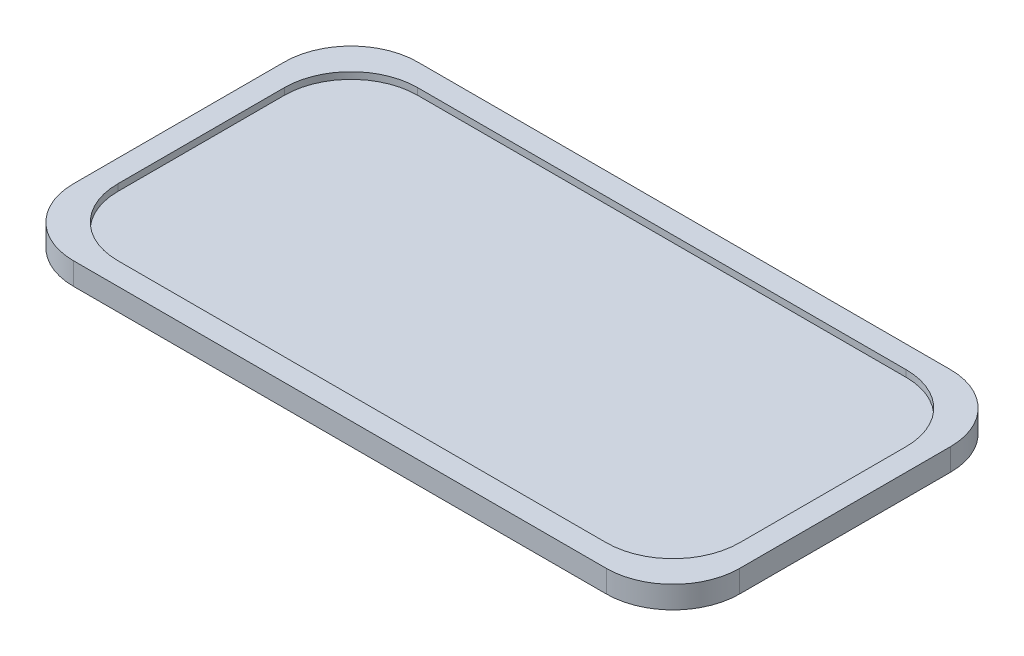
ISO-10303-21;
HEADER;
FILE_DESCRIPTION(('STEP AP214'),'2;1');
FILE_NAME('part.step','',(''),(''),'','','');
FILE_SCHEMA(('AUTOMOTIVE_DESIGN { 1 0 10303 214 1 1 1 1 }'));
ENDSEC;
DATA;
#1=APPLICATION_CONTEXT('core data for automotive mechanical design processes');
#2=APPLICATION_PROTOCOL_DEFINITION('international standard','automotive_design',2000,#1);
#3=PRODUCT_CONTEXT('',#1,'mechanical');
#4=PRODUCT('Part','Part','',(#3));
#5=PRODUCT_RELATED_PRODUCT_CATEGORY('part','',(#4));
#6=PRODUCT_DEFINITION_FORMATION('','',#4);
#7=PRODUCT_DEFINITION_CONTEXT('part definition',#1,'design');
#8=PRODUCT_DEFINITION('design','',#6,#7);
#9=PRODUCT_DEFINITION_SHAPE('','',#8);
#10=(LENGTH_UNIT() NAMED_UNIT(*) SI_UNIT(.MILLI.,.METRE.));
#11=(NAMED_UNIT(*) PLANE_ANGLE_UNIT() SI_UNIT($,.RADIAN.));
#12=(NAMED_UNIT(*) SI_UNIT($,.STERADIAN.) SOLID_ANGLE_UNIT());
#13=UNCERTAINTY_MEASURE_WITH_UNIT(LENGTH_MEASURE(1.E-05),#10,'distance_accuracy_value','');
#14=(GEOMETRIC_REPRESENTATION_CONTEXT(3) GLOBAL_UNCERTAINTY_ASSIGNED_CONTEXT((#13)) GLOBAL_UNIT_ASSIGNED_CONTEXT((#10,
#11,#12)) REPRESENTATION_CONTEXT('',''));
#15=CARTESIAN_POINT('',(0.,0.,0.));
#16=DIRECTION('',(0.,0.,1.));
#17=DIRECTION('',(1.,0.,0.));
#18=AXIS2_PLACEMENT_3D('',#15,#16,#17);
#19=CARTESIAN_POINT('',(120.,10.,-47.5));
#20=DIRECTION('',(0.,-1.,0.));
#21=DIRECTION('',(0.,0.,-1.));
#22=AXIS2_PLACEMENT_3D('',#19,#20,#21);
#23=CYLINDRICAL_SURFACE('',#22,30.);
#24=CARTESIAN_POINT('',(120.,0.,-47.5));
#25=DIRECTION('',(0.,1.,0.));
#26=DIRECTION('',(0.,0.,1.));
#27=AXIS2_PLACEMENT_3D('',#24,#25,#26);
#28=CIRCLE('',#27,30.);
#29=CARTESIAN_POINT('',(150.,0.,-47.5));
#30=VERTEX_POINT('',#29);
#31=CARTESIAN_POINT('',(120.,0.,-77.5));
#32=VERTEX_POINT('',#31);
#33=EDGE_CURVE('E424',#30,#32,#28,.T.);
#34=ORIENTED_EDGE('',*,*,#33,.T.);
#35=DIRECTION('',(0.,-1.,0.));
#36=VECTOR('',#35,1.);
#37=CARTESIAN_POINT('',(120.,10.,-77.5));
#38=LINE('',#37,#36);
#39=CARTESIAN_POINT('',(120.,10.,-77.5));
#40=VERTEX_POINT('',#39);
#41=EDGE_CURVE('E11',#40,#32,#38,.T.);
#42=ORIENTED_EDGE('',*,*,#41,.F.);
#43=CARTESIAN_POINT('',(120.,10.,-47.5));
#44=DIRECTION('',(0.,1.,0.));
#45=DIRECTION('',(0.,0.,1.));
#46=AXIS2_PLACEMENT_3D('',#43,#44,#45);
#47=CIRCLE('',#46,30.);
#48=CARTESIAN_POINT('',(150.,10.,-47.5));
#49=VERTEX_POINT('',#48);
#50=EDGE_CURVE('E438',#49,#40,#47,.T.);
#51=ORIENTED_EDGE('',*,*,#50,.F.);
#52=DIRECTION('',(0.,-1.,0.));
#53=VECTOR('',#52,1.);
#54=CARTESIAN_POINT('',(150.,10.,-47.5));
#55=LINE('',#54,#53);
#56=EDGE_CURVE('E456',#49,#30,#55,.T.);
#57=ORIENTED_EDGE('',*,*,#56,.T.);
#58=EDGE_LOOP('',(#34,#42,#51,#57));
#59=FACE_BOUND('',#58,.T.);
#60=ADVANCED_FACE('F32',(#59),#23,.T.);
#61=CARTESIAN_POINT('',(-120.,10.,-77.5));
#62=DIRECTION('',(0.,0.,1.));
#63=DIRECTION('',(1.,0.,0.));
#64=AXIS2_PLACEMENT_3D('',#61,#62,#63);
#65=PLANE('',#64);
#66=DIRECTION('',(-1.,0.,0.));
#67=VECTOR('',#66,1.);
#68=CARTESIAN_POINT('',(-120.,0.,-77.5));
#69=LINE('',#68,#67);
#70=CARTESIAN_POINT('',(-120.,0.,-77.5));
#71=VERTEX_POINT('',#70);
#72=EDGE_CURVE('E459',#32,#71,#69,.T.);
#73=ORIENTED_EDGE('',*,*,#72,.T.);
#74=DIRECTION('',(0.,-1.,0.));
#75=VECTOR('',#74,1.);
#76=CARTESIAN_POINT('',(-120.,10.,-77.5));
#77=LINE('',#76,#75);
#78=CARTESIAN_POINT('',(-120.,10.,-77.5));
#79=VERTEX_POINT('',#78);
#80=EDGE_CURVE('E39',#79,#71,#77,.T.);
#81=ORIENTED_EDGE('',*,*,#80,.F.);
#82=DIRECTION('',(-1.,0.,0.));
#83=VECTOR('',#82,1.);
#84=CARTESIAN_POINT('',(-120.,10.,-77.5));
#85=LINE('',#84,#83);
#86=EDGE_CURVE('E441',#40,#79,#85,.T.);
#87=ORIENTED_EDGE('',*,*,#86,.F.);
#88=ORIENTED_EDGE('',*,*,#41,.T.);
#89=EDGE_LOOP('',(#73,#81,#87,#88));
#90=FACE_BOUND('',#89,.T.);
#91=ADVANCED_FACE('F516',(#90),#65,.F.);
#92=CARTESIAN_POINT('',(-120.,10.,-47.5));
#93=DIRECTION('',(0.,-1.,0.));
#94=DIRECTION('',(0.,0.,-1.));
#95=AXIS2_PLACEMENT_3D('',#92,#93,#94);
#96=CYLINDRICAL_SURFACE('',#95,30.);
#97=CARTESIAN_POINT('',(-120.,0.,-47.5));
#98=DIRECTION('',(0.,1.,0.));
#99=DIRECTION('',(0.,0.,-1.));
#100=AXIS2_PLACEMENT_3D('',#97,#98,#99);
#101=CIRCLE('',#100,30.);
#102=CARTESIAN_POINT('',(-150.,0.,-47.5));
#103=VERTEX_POINT('',#102);
#104=EDGE_CURVE('E461',#71,#103,#101,.T.);
#105=ORIENTED_EDGE('',*,*,#104,.T.);
#106=DIRECTION('',(0.,-1.,0.));
#107=VECTOR('',#106,1.);
#108=CARTESIAN_POINT('',(-150.,10.,-47.5));
#109=LINE('',#108,#107);
#110=CARTESIAN_POINT('',(-150.,10.,-47.5));
#111=VERTEX_POINT('',#110);
#112=EDGE_CURVE('E486',#111,#103,#109,.T.);
#113=ORIENTED_EDGE('',*,*,#112,.F.);
#114=CARTESIAN_POINT('',(-120.,10.,-47.5));
#115=DIRECTION('',(0.,1.,0.));
#116=DIRECTION('',(0.,0.,-1.));
#117=AXIS2_PLACEMENT_3D('',#114,#115,#116);
#118=CIRCLE('',#117,30.);
#119=EDGE_CURVE('E444',#79,#111,#118,.T.);
#120=ORIENTED_EDGE('',*,*,#119,.F.);
#121=ORIENTED_EDGE('',*,*,#80,.T.);
#122=EDGE_LOOP('',(#105,#113,#120,#121));
#123=FACE_BOUND('',#122,.T.);
#124=ADVANCED_FACE('F493',(#123),#96,.T.);
#125=CARTESIAN_POINT('',(-150.,10.,-47.5));
#126=DIRECTION('',(1.,0.,0.));
#127=DIRECTION('',(0.,0.,-1.));
#128=AXIS2_PLACEMENT_3D('',#125,#126,#127);
#129=PLANE('',#128);
#130=DIRECTION('',(0.,0.,1.));
#131=VECTOR('',#130,1.);
#132=CARTESIAN_POINT('',(-150.,0.,-47.5));
#133=LINE('',#132,#131);
#134=CARTESIAN_POINT('',(-150.,0.,47.5));
#135=VERTEX_POINT('',#134);
#136=EDGE_CURVE('E463',#103,#135,#133,.T.);
#137=ORIENTED_EDGE('',*,*,#136,.T.);
#138=DIRECTION('',(0.,-1.,0.));
#139=VECTOR('',#138,1.);
#140=CARTESIAN_POINT('',(-150.,10.,47.5));
#141=LINE('',#140,#139);
#142=CARTESIAN_POINT('',(-150.,10.,47.5));
#143=VERTEX_POINT('',#142);
#144=EDGE_CURVE('E483',#143,#135,#141,.T.);
#145=ORIENTED_EDGE('',*,*,#144,.F.);
#146=DIRECTION('',(0.,0.,1.));
#147=VECTOR('',#146,1.);
#148=CARTESIAN_POINT('',(-150.,10.,-47.5));
#149=LINE('',#148,#147);
#150=EDGE_CURVE('E446',#111,#143,#149,.T.);
#151=ORIENTED_EDGE('',*,*,#150,.F.);
#152=ORIENTED_EDGE('',*,*,#112,.T.);
#153=EDGE_LOOP('',(#137,#145,#151,#152));
#154=FACE_BOUND('',#153,.T.);
#155=ADVANCED_FACE('F504',(#154),#129,.F.);
#156=CARTESIAN_POINT('',(-120.,10.,47.5));
#157=DIRECTION('',(0.,-1.,0.));
#158=DIRECTION('',(0.,0.,-1.));
#159=AXIS2_PLACEMENT_3D('',#156,#157,#158);
#160=CYLINDRICAL_SURFACE('',#159,30.);
#161=CARTESIAN_POINT('',(-120.,0.,47.5));
#162=DIRECTION('',(0.,1.,0.));
#163=DIRECTION('',(0.,0.,-1.));
#164=AXIS2_PLACEMENT_3D('',#161,#162,#163);
#165=CIRCLE('',#164,30.);
#166=CARTESIAN_POINT('',(-120.,0.,77.5));
#167=VERTEX_POINT('',#166);
#168=EDGE_CURVE('E465',#135,#167,#165,.T.);
#169=ORIENTED_EDGE('',*,*,#168,.T.);
#170=DIRECTION('',(0.,-1.,0.));
#171=VECTOR('',#170,1.);
#172=CARTESIAN_POINT('',(-120.,10.,77.5));
#173=LINE('',#172,#171);
#174=CARTESIAN_POINT('',(-120.,10.,77.5));
#175=VERTEX_POINT('',#174);
#176=EDGE_CURVE('E480',#175,#167,#173,.T.);
#177=ORIENTED_EDGE('',*,*,#176,.F.);
#178=CARTESIAN_POINT('',(-120.,10.,47.5));
#179=DIRECTION('',(0.,1.,0.));
#180=DIRECTION('',(0.,0.,-1.));
#181=AXIS2_PLACEMENT_3D('',#178,#179,#180);
#182=CIRCLE('',#181,30.);
#183=EDGE_CURVE('E448',#143,#175,#182,.T.);
#184=ORIENTED_EDGE('',*,*,#183,.F.);
#185=ORIENTED_EDGE('',*,*,#144,.T.);
#186=EDGE_LOOP('',(#169,#177,#184,#185));
#187=FACE_BOUND('',#186,.T.);
#188=ADVANCED_FACE('F508',(#187),#160,.T.);
#189=CARTESIAN_POINT('',(-120.,10.,77.5));
#190=DIRECTION('',(0.,0.,-1.));
#191=DIRECTION('',(-1.,0.,0.));
#192=AXIS2_PLACEMENT_3D('',#189,#190,#191);
#193=PLANE('',#192);
#194=DIRECTION('',(1.,0.,0.));
#195=VECTOR('',#194,1.);
#196=CARTESIAN_POINT('',(-120.,0.,77.5));
#197=LINE('',#196,#195);
#198=CARTESIAN_POINT('',(120.,0.,77.5));
#199=VERTEX_POINT('',#198);
#200=EDGE_CURVE('E467',#167,#199,#197,.T.);
#201=ORIENTED_EDGE('',*,*,#200,.T.);
#202=DIRECTION('',(0.,-1.,0.));
#203=VECTOR('',#202,1.);
#204=CARTESIAN_POINT('',(120.,10.,77.5));
#205=LINE('',#204,#203);
#206=CARTESIAN_POINT('',(120.,10.,77.5));
#207=VERTEX_POINT('',#206);
#208=EDGE_CURVE('E477',#207,#199,#205,.T.);
#209=ORIENTED_EDGE('',*,*,#208,.F.);
#210=DIRECTION('',(1.,0.,0.));
#211=VECTOR('',#210,1.);
#212=CARTESIAN_POINT('',(-120.,10.,77.5));
#213=LINE('',#212,#211);
#214=EDGE_CURVE('E450',#175,#207,#213,.T.);
#215=ORIENTED_EDGE('',*,*,#214,.F.);
#216=ORIENTED_EDGE('',*,*,#176,.T.);
#217=EDGE_LOOP('',(#201,#209,#215,#216));
#218=FACE_BOUND('',#217,.T.);
#219=ADVANCED_FACE('F529',(#218),#193,.F.);
#220=CARTESIAN_POINT('',(120.,10.,47.5));
#221=DIRECTION('',(0.,-1.,0.));
#222=DIRECTION('',(0.,0.,-1.));
#223=AXIS2_PLACEMENT_3D('',#220,#221,#222);
#224=CYLINDRICAL_SURFACE('',#223,30.);
#225=CARTESIAN_POINT('',(120.,0.,47.5));
#226=DIRECTION('',(0.,1.,0.));
#227=DIRECTION('',(0.,0.,1.));
#228=AXIS2_PLACEMENT_3D('',#225,#226,#227);
#229=CIRCLE('',#228,30.);
#230=CARTESIAN_POINT('',(150.,0.,47.5));
#231=VERTEX_POINT('',#230);
#232=EDGE_CURVE('E469',#199,#231,#229,.T.);
#233=ORIENTED_EDGE('',*,*,#232,.T.);
#234=DIRECTION('',(0.,-1.,0.));
#235=VECTOR('',#234,1.);
#236=CARTESIAN_POINT('',(150.,10.,47.5));
#237=LINE('',#236,#235);
#238=CARTESIAN_POINT('',(150.,10.,47.5));
#239=VERTEX_POINT('',#238);
#240=EDGE_CURVE('E474',#239,#231,#237,.T.);
#241=ORIENTED_EDGE('',*,*,#240,.F.);
#242=CARTESIAN_POINT('',(120.,10.,47.5));
#243=DIRECTION('',(0.,1.,0.));
#244=DIRECTION('',(0.,0.,1.));
#245=AXIS2_PLACEMENT_3D('',#242,#243,#244);
#246=CIRCLE('',#245,30.);
#247=EDGE_CURVE('E452',#207,#239,#246,.T.);
#248=ORIENTED_EDGE('',*,*,#247,.F.);
#249=ORIENTED_EDGE('',*,*,#208,.T.);
#250=EDGE_LOOP('',(#233,#241,#248,#249));
#251=FACE_BOUND('',#250,.T.);
#252=ADVANCED_FACE('F527',(#251),#224,.T.);
#253=CARTESIAN_POINT('',(150.,10.,-47.5));
#254=DIRECTION('',(-1.,0.,0.));
#255=DIRECTION('',(0.,0.,1.));
#256=AXIS2_PLACEMENT_3D('',#253,#254,#255);
#257=PLANE('',#256);
#258=DIRECTION('',(0.,0.,-1.));
#259=VECTOR('',#258,1.);
#260=CARTESIAN_POINT('',(150.,0.,-47.5));
#261=LINE('',#260,#259);
#262=EDGE_CURVE('E442',#231,#30,#261,.T.);
#263=ORIENTED_EDGE('',*,*,#262,.T.);
#264=ORIENTED_EDGE('',*,*,#56,.F.);
#265=DIRECTION('',(0.,0.,-1.));
#266=VECTOR('',#265,1.);
#267=CARTESIAN_POINT('',(150.,10.,-47.5));
#268=LINE('',#267,#266);
#269=EDGE_CURVE('E454',#239,#49,#268,.T.);
#270=ORIENTED_EDGE('',*,*,#269,.F.);
#271=ORIENTED_EDGE('',*,*,#240,.T.);
#272=EDGE_LOOP('',(#263,#264,#270,#271));
#273=FACE_BOUND('',#272,.T.);
#274=ADVANCED_FACE('F522',(#273),#257,.F.);
#275=CARTESIAN_POINT('',(120.,10.,-47.5));
#276=DIRECTION('',(0.,1.,0.));
#277=DIRECTION('',(0.,0.,1.));
#278=AXIS2_PLACEMENT_3D('',#275,#276,#277);
#279=PLANE('',#278);
#280=CARTESIAN_POINT('',(110.,10.,-37.5));
#281=DIRECTION('',(0.,1.,0.));
#282=DIRECTION('',(0.,0.,1.));
#283=AXIS2_PLACEMENT_3D('',#280,#281,#282);
#284=CIRCLE('',#283,30.);
#285=CARTESIAN_POINT('',(140.,10.,-37.5));
#286=VERTEX_POINT('',#285);
#287=CARTESIAN_POINT('',(110.,10.,-67.5));
#288=VERTEX_POINT('',#287);
#289=EDGE_CURVE('E46',#286,#288,#284,.T.);
#290=ORIENTED_EDGE('',*,*,#289,.F.);
#291=DIRECTION('',(0.,0.,-1.));
#292=VECTOR('',#291,1.);
#293=CARTESIAN_POINT('',(140.,10.,-37.5));
#294=LINE('',#293,#292);
#295=CARTESIAN_POINT('',(140.,10.,37.5));
#296=VERTEX_POINT('',#295);
#297=EDGE_CURVE('E261',#296,#286,#294,.T.);
#298=ORIENTED_EDGE('',*,*,#297,.F.);
#299=CARTESIAN_POINT('',(110.,10.,37.5));
#300=DIRECTION('',(0.,1.,0.));
#301=DIRECTION('',(0.,0.,1.));
#302=AXIS2_PLACEMENT_3D('',#299,#300,#301);
#303=CIRCLE('',#302,30.);
#304=CARTESIAN_POINT('',(110.,10.,67.5));
#305=VERTEX_POINT('',#304);
#306=EDGE_CURVE('E264',#305,#296,#303,.T.);
#307=ORIENTED_EDGE('',*,*,#306,.F.);
#308=DIRECTION('',(1.,0.,0.));
#309=VECTOR('',#308,1.);
#310=CARTESIAN_POINT('',(-110.,10.,67.5));
#311=LINE('',#310,#309);
#312=CARTESIAN_POINT('',(-110.,10.,67.5));
#313=VERTEX_POINT('',#312);
#314=EDGE_CURVE('E292',#313,#305,#311,.T.);
#315=ORIENTED_EDGE('',*,*,#314,.F.);
#316=CARTESIAN_POINT('',(-110.,10.,37.5));
#317=DIRECTION('',(0.,1.,0.));
#318=DIRECTION('',(0.,0.,-1.));
#319=AXIS2_PLACEMENT_3D('',#316,#317,#318);
#320=CIRCLE('',#319,30.);
#321=CARTESIAN_POINT('',(-140.,10.,37.5));
#322=VERTEX_POINT('',#321);
#323=EDGE_CURVE('E289',#322,#313,#320,.T.);
#324=ORIENTED_EDGE('',*,*,#323,.F.);
#325=DIRECTION('',(0.,0.,1.));
#326=VECTOR('',#325,1.);
#327=CARTESIAN_POINT('',(-140.,10.,-37.5));
#328=LINE('',#327,#326);
#329=CARTESIAN_POINT('',(-140.,10.,-37.5));
#330=VERTEX_POINT('',#329);
#331=EDGE_CURVE('E286',#330,#322,#328,.T.);
#332=ORIENTED_EDGE('',*,*,#331,.F.);
#333=CARTESIAN_POINT('',(-110.,10.,-37.5));
#334=DIRECTION('',(0.,1.,0.));
#335=DIRECTION('',(0.,0.,-1.));
#336=AXIS2_PLACEMENT_3D('',#333,#334,#335);
#337=CIRCLE('',#336,30.);
#338=CARTESIAN_POINT('',(-110.,10.,-67.5));
#339=VERTEX_POINT('',#338);
#340=EDGE_CURVE('E283',#339,#330,#337,.T.);
#341=ORIENTED_EDGE('',*,*,#340,.F.);
#342=DIRECTION('',(-1.,0.,0.));
#343=VECTOR('',#342,1.);
#344=CARTESIAN_POINT('',(-110.,10.,-67.5));
#345=LINE('',#344,#343);
#346=EDGE_CURVE('E281',#288,#339,#345,.T.);
#347=ORIENTED_EDGE('',*,*,#346,.F.);
#348=EDGE_LOOP('',(#290,#298,#307,#315,#324,#332,#341,#347));
#349=FACE_BOUND('',#348,.T.);
#350=ORIENTED_EDGE('',*,*,#50,.T.);
#351=ORIENTED_EDGE('',*,*,#86,.T.);
#352=ORIENTED_EDGE('',*,*,#119,.T.);
#353=ORIENTED_EDGE('',*,*,#150,.T.);
#354=ORIENTED_EDGE('',*,*,#183,.T.);
#355=ORIENTED_EDGE('',*,*,#214,.T.);
#356=ORIENTED_EDGE('',*,*,#247,.T.);
#357=ORIENTED_EDGE('',*,*,#269,.T.);
#358=EDGE_LOOP('',(#350,#351,#352,#353,#354,#355,#356,#357));
#359=FACE_BOUND('',#358,.T.);
#360=ADVANCED_FACE('F512',(#349,#359),#279,.T.);
#361=CARTESIAN_POINT('',(120.,0.,-47.5));
#362=DIRECTION('',(0.,1.,0.));
#363=DIRECTION('',(0.,0.,1.));
#364=AXIS2_PLACEMENT_3D('',#361,#362,#363);
#365=PLANE('',#364);
#366=DIRECTION('',(0.,0.,-1.));
#367=VECTOR('',#366,1.);
#368=CARTESIAN_POINT('',(-146.,0.,37.5));
#369=LINE('',#368,#367);
#370=CARTESIAN_POINT('',(-146.,0.,37.5));
#371=VERTEX_POINT('',#370);
#372=CARTESIAN_POINT('',(-146.,0.,-37.5));
#373=VERTEX_POINT('',#372);
#374=EDGE_CURVE('E402',#371,#373,#369,.T.);
#375=ORIENTED_EDGE('',*,*,#374,.F.);
#376=CARTESIAN_POINT('',(-110.,0.,37.5));
#377=DIRECTION('',(0.,-1.,0.));
#378=DIRECTION('',(0.,0.,1.));
#379=AXIS2_PLACEMENT_3D('',#376,#377,#378);
#380=CIRCLE('',#379,36.);
#381=CARTESIAN_POINT('',(-110.,0.,73.5));
#382=VERTEX_POINT('',#381);
#383=EDGE_CURVE('E54',#382,#371,#380,.T.);
#384=ORIENTED_EDGE('',*,*,#383,.F.);
#385=DIRECTION('',(-1.,0.,0.));
#386=VECTOR('',#385,1.);
#387=CARTESIAN_POINT('',(-110.,0.,73.5));
#388=LINE('',#387,#386);
#389=CARTESIAN_POINT('',(110.,0.,73.5));
#390=VERTEX_POINT('',#389);
#391=EDGE_CURVE('E379',#390,#382,#388,.T.);
#392=ORIENTED_EDGE('',*,*,#391,.F.);
#393=CARTESIAN_POINT('',(110.,0.,37.5));
#394=DIRECTION('',(0.,-1.,0.));
#395=DIRECTION('',(0.,0.,-1.));
#396=AXIS2_PLACEMENT_3D('',#393,#394,#395);
#397=CIRCLE('',#396,36.);
#398=CARTESIAN_POINT('',(146.,0.,37.5));
#399=VERTEX_POINT('',#398);
#400=EDGE_CURVE('E417',#399,#390,#397,.T.);
#401=ORIENTED_EDGE('',*,*,#400,.F.);
#402=DIRECTION('',(0.,0.,1.));
#403=VECTOR('',#402,1.);
#404=CARTESIAN_POINT('',(146.,0.,37.5));
#405=LINE('',#404,#403);
#406=CARTESIAN_POINT('',(146.,0.,-37.5));
#407=VERTEX_POINT('',#406);
#408=EDGE_CURVE('E414',#407,#399,#405,.T.);
#409=ORIENTED_EDGE('',*,*,#408,.F.);
#410=CARTESIAN_POINT('',(110.,0.,-37.5));
#411=DIRECTION('',(0.,-1.,0.));
#412=DIRECTION('',(0.,0.,-1.));
#413=AXIS2_PLACEMENT_3D('',#410,#411,#412);
#414=CIRCLE('',#413,36.);
#415=CARTESIAN_POINT('',(110.,0.,-73.5));
#416=VERTEX_POINT('',#415);
#417=EDGE_CURVE('E411',#416,#407,#414,.T.);
#418=ORIENTED_EDGE('',*,*,#417,.F.);
#419=DIRECTION('',(1.,0.,0.));
#420=VECTOR('',#419,1.);
#421=CARTESIAN_POINT('',(-110.,0.,-73.5));
#422=LINE('',#421,#420);
#423=CARTESIAN_POINT('',(-110.,0.,-73.5));
#424=VERTEX_POINT('',#423);
#425=EDGE_CURVE('E408',#424,#416,#422,.T.);
#426=ORIENTED_EDGE('',*,*,#425,.F.);
#427=CARTESIAN_POINT('',(-110.,0.,-37.5));
#428=DIRECTION('',(0.,-1.,0.));
#429=DIRECTION('',(0.,0.,1.));
#430=AXIS2_PLACEMENT_3D('',#427,#428,#429);
#431=CIRCLE('',#430,36.);
#432=EDGE_CURVE('E405',#373,#424,#431,.T.);
#433=ORIENTED_EDGE('',*,*,#432,.F.);
#434=EDGE_LOOP('',(#375,#384,#392,#401,#409,#418,#426,#433));
#435=FACE_BOUND('',#434,.T.);
#436=ORIENTED_EDGE('',*,*,#33,.F.);
#437=ORIENTED_EDGE('',*,*,#262,.F.);
#438=ORIENTED_EDGE('',*,*,#232,.F.);
#439=ORIENTED_EDGE('',*,*,#200,.F.);
#440=ORIENTED_EDGE('',*,*,#168,.F.);
#441=ORIENTED_EDGE('',*,*,#136,.F.);
#442=ORIENTED_EDGE('',*,*,#104,.F.);
#443=ORIENTED_EDGE('',*,*,#72,.F.);
#444=EDGE_LOOP('',(#436,#437,#438,#439,#440,#441,#442,#443));
#445=FACE_BOUND('',#444,.T.);
#446=ADVANCED_FACE('F499',(#435,#445),#365,.F.);
#447=CARTESIAN_POINT('',(-110.,5.,37.5));
#448=DIRECTION('',(0.,-1.,0.));
#449=DIRECTION('',(0.,0.,-1.));
#450=AXIS2_PLACEMENT_3D('',#447,#448,#449);
#451=CYLINDRICAL_SURFACE('',#450,36.);
#452=ORIENTED_EDGE('',*,*,#383,.T.);
#453=DIRECTION('',(0.,-1.,0.));
#454=VECTOR('',#453,1.);
#455=CARTESIAN_POINT('',(-146.,5.,37.5));
#456=LINE('',#455,#454);
#457=CARTESIAN_POINT('',(-146.,5.,37.5));
#458=VERTEX_POINT('',#457);
#459=EDGE_CURVE('E400',#458,#371,#456,.T.);
#460=ORIENTED_EDGE('',*,*,#459,.F.);
#461=CARTESIAN_POINT('',(-110.,5.,37.5));
#462=DIRECTION('',(0.,-1.,0.));
#463=DIRECTION('',(0.,0.,1.));
#464=AXIS2_PLACEMENT_3D('',#461,#462,#463);
#465=CIRCLE('',#464,36.);
#466=CARTESIAN_POINT('',(-110.,5.,73.5));
#467=VERTEX_POINT('',#466);
#468=EDGE_CURVE('E375',#467,#458,#465,.T.);
#469=ORIENTED_EDGE('',*,*,#468,.F.);
#470=DIRECTION('',(0.,-1.,0.));
#471=VECTOR('',#470,1.);
#472=CARTESIAN_POINT('',(-110.,5.,73.5));
#473=LINE('',#472,#471);
#474=EDGE_CURVE('E422',#467,#382,#473,.T.);
#475=ORIENTED_EDGE('',*,*,#474,.T.);
#476=EDGE_LOOP('',(#452,#460,#469,#475));
#477=FACE_BOUND('',#476,.T.);
#478=ADVANCED_FACE('F585',(#477),#451,.F.);
#479=CARTESIAN_POINT('',(-110.,5.,73.5));
#480=DIRECTION('',(0.,0.,1.));
#481=DIRECTION('',(1.,0.,0.));
#482=AXIS2_PLACEMENT_3D('',#479,#480,#481);
#483=PLANE('',#482);
#484=ORIENTED_EDGE('',*,*,#391,.T.);
#485=ORIENTED_EDGE('',*,*,#474,.F.);
#486=DIRECTION('',(-1.,0.,0.));
#487=VECTOR('',#486,1.);
#488=CARTESIAN_POINT('',(-110.,5.,73.5));
#489=LINE('',#488,#487);
#490=CARTESIAN_POINT('',(110.,5.,73.5));
#491=VERTEX_POINT('',#490);
#492=EDGE_CURVE('E397',#491,#467,#489,.T.);
#493=ORIENTED_EDGE('',*,*,#492,.F.);
#494=DIRECTION('',(0.,-1.,0.));
#495=VECTOR('',#494,1.);
#496=CARTESIAN_POINT('',(110.,5.,73.5));
#497=LINE('',#496,#495);
#498=EDGE_CURVE('E425',#491,#390,#497,.T.);
#499=ORIENTED_EDGE('',*,*,#498,.T.);
#500=EDGE_LOOP('',(#484,#485,#493,#499));
#501=FACE_BOUND('',#500,.T.);
#502=ADVANCED_FACE('F597',(#501),#483,.F.);
#503=CARTESIAN_POINT('',(110.,5.,37.5));
#504=DIRECTION('',(0.,-1.,0.));
#505=DIRECTION('',(0.,0.,-1.));
#506=AXIS2_PLACEMENT_3D('',#503,#504,#505);
#507=CYLINDRICAL_SURFACE('',#506,36.);
#508=ORIENTED_EDGE('',*,*,#400,.T.);
#509=ORIENTED_EDGE('',*,*,#498,.F.);
#510=CARTESIAN_POINT('',(110.,5.,37.5));
#511=DIRECTION('',(0.,-1.,0.));
#512=DIRECTION('',(0.,0.,-1.));
#513=AXIS2_PLACEMENT_3D('',#510,#511,#512);
#514=CIRCLE('',#513,36.);
#515=CARTESIAN_POINT('',(146.,5.,37.5));
#516=VERTEX_POINT('',#515);
#517=EDGE_CURVE('E394',#516,#491,#514,.T.);
#518=ORIENTED_EDGE('',*,*,#517,.F.);
#519=DIRECTION('',(0.,-1.,0.));
#520=VECTOR('',#519,1.);
#521=CARTESIAN_POINT('',(146.,5.,37.5));
#522=LINE('',#521,#520);
#523=EDGE_CURVE('E427',#516,#399,#522,.T.);
#524=ORIENTED_EDGE('',*,*,#523,.T.);
#525=EDGE_LOOP('',(#508,#509,#518,#524));
#526=FACE_BOUND('',#525,.T.);
#527=ADVANCED_FACE('F606',(#526),#507,.F.);
#528=CARTESIAN_POINT('',(146.,5.,37.5));
#529=DIRECTION('',(1.,0.,0.));
#530=DIRECTION('',(0.,0.,-1.));
#531=AXIS2_PLACEMENT_3D('',#528,#529,#530);
#532=PLANE('',#531);
#533=ORIENTED_EDGE('',*,*,#408,.T.);
#534=ORIENTED_EDGE('',*,*,#523,.F.);
#535=DIRECTION('',(0.,0.,1.));
#536=VECTOR('',#535,1.);
#537=CARTESIAN_POINT('',(146.,5.,37.5));
#538=LINE('',#537,#536);
#539=CARTESIAN_POINT('',(146.,5.,-37.5));
#540=VERTEX_POINT('',#539);
#541=EDGE_CURVE('E391',#540,#516,#538,.T.);
#542=ORIENTED_EDGE('',*,*,#541,.F.);
#543=DIRECTION('',(0.,-1.,0.));
#544=VECTOR('',#543,1.);
#545=CARTESIAN_POINT('',(146.,5.,-37.5));
#546=LINE('',#545,#544);
#547=EDGE_CURVE('E429',#540,#407,#546,.T.);
#548=ORIENTED_EDGE('',*,*,#547,.T.);
#549=EDGE_LOOP('',(#533,#534,#542,#548));
#550=FACE_BOUND('',#549,.T.);
#551=ADVANCED_FACE('F616',(#550),#532,.F.);
#552=CARTESIAN_POINT('',(110.,5.,-37.5));
#553=DIRECTION('',(0.,-1.,0.));
#554=DIRECTION('',(0.,0.,-1.));
#555=AXIS2_PLACEMENT_3D('',#552,#553,#554);
#556=CYLINDRICAL_SURFACE('',#555,36.);
#557=ORIENTED_EDGE('',*,*,#417,.T.);
#558=ORIENTED_EDGE('',*,*,#547,.F.);
#559=CARTESIAN_POINT('',(110.,5.,-37.5));
#560=DIRECTION('',(0.,-1.,0.));
#561=DIRECTION('',(0.,0.,-1.));
#562=AXIS2_PLACEMENT_3D('',#559,#560,#561);
#563=CIRCLE('',#562,36.);
#564=CARTESIAN_POINT('',(110.,5.,-73.5));
#565=VERTEX_POINT('',#564);
#566=EDGE_CURVE('E388',#565,#540,#563,.T.);
#567=ORIENTED_EDGE('',*,*,#566,.F.);
#568=DIRECTION('',(0.,-1.,0.));
#569=VECTOR('',#568,1.);
#570=CARTESIAN_POINT('',(110.,5.,-73.5));
#571=LINE('',#570,#569);
#572=EDGE_CURVE('E431',#565,#416,#571,.T.);
#573=ORIENTED_EDGE('',*,*,#572,.T.);
#574=EDGE_LOOP('',(#557,#558,#567,#573));
#575=FACE_BOUND('',#574,.T.);
#576=ADVANCED_FACE('F626',(#575),#556,.F.);
#577=CARTESIAN_POINT('',(-110.,5.,-73.5));
#578=DIRECTION('',(0.,0.,-1.));
#579=DIRECTION('',(-1.,0.,0.));
#580=AXIS2_PLACEMENT_3D('',#577,#578,#579);
#581=PLANE('',#580);
#582=ORIENTED_EDGE('',*,*,#425,.T.);
#583=ORIENTED_EDGE('',*,*,#572,.F.);
#584=DIRECTION('',(1.,0.,0.));
#585=VECTOR('',#584,1.);
#586=CARTESIAN_POINT('',(-110.,5.,-73.5));
#587=LINE('',#586,#585);
#588=CARTESIAN_POINT('',(-110.,5.,-73.5));
#589=VERTEX_POINT('',#588);
#590=EDGE_CURVE('E385',#589,#565,#587,.T.);
#591=ORIENTED_EDGE('',*,*,#590,.F.);
#592=DIRECTION('',(0.,-1.,0.));
#593=VECTOR('',#592,1.);
#594=CARTESIAN_POINT('',(-110.,5.,-73.5));
#595=LINE('',#594,#593);
#596=EDGE_CURVE('E433',#589,#424,#595,.T.);
#597=ORIENTED_EDGE('',*,*,#596,.T.);
#598=EDGE_LOOP('',(#582,#583,#591,#597));
#599=FACE_BOUND('',#598,.T.);
#600=ADVANCED_FACE('F636',(#599),#581,.F.);
#601=CARTESIAN_POINT('',(-110.,5.,-37.5));
#602=DIRECTION('',(0.,-1.,0.));
#603=DIRECTION('',(0.,0.,-1.));
#604=AXIS2_PLACEMENT_3D('',#601,#602,#603);
#605=CYLINDRICAL_SURFACE('',#604,36.);
#606=ORIENTED_EDGE('',*,*,#432,.T.);
#607=ORIENTED_EDGE('',*,*,#596,.F.);
#608=CARTESIAN_POINT('',(-110.,5.,-37.5));
#609=DIRECTION('',(0.,-1.,0.));
#610=DIRECTION('',(0.,0.,1.));
#611=AXIS2_PLACEMENT_3D('',#608,#609,#610);
#612=CIRCLE('',#611,36.);
#613=CARTESIAN_POINT('',(-146.,5.,-37.5));
#614=VERTEX_POINT('',#613);
#615=EDGE_CURVE('E382',#614,#589,#612,.T.);
#616=ORIENTED_EDGE('',*,*,#615,.F.);
#617=DIRECTION('',(0.,-1.,0.));
#618=VECTOR('',#617,1.);
#619=CARTESIAN_POINT('',(-146.,5.,-37.5));
#620=LINE('',#619,#618);
#621=EDGE_CURVE('E435',#614,#373,#620,.T.);
#622=ORIENTED_EDGE('',*,*,#621,.T.);
#623=EDGE_LOOP('',(#606,#607,#616,#622));
#624=FACE_BOUND('',#623,.T.);
#625=ADVANCED_FACE('F646',(#624),#605,.F.);
#626=CARTESIAN_POINT('',(-146.,5.,37.5));
#627=DIRECTION('',(-1.,0.,0.));
#628=DIRECTION('',(0.,0.,1.));
#629=AXIS2_PLACEMENT_3D('',#626,#627,#628);
#630=PLANE('',#629);
#631=ORIENTED_EDGE('',*,*,#374,.T.);
#632=ORIENTED_EDGE('',*,*,#621,.F.);
#633=DIRECTION('',(0.,0.,-1.));
#634=VECTOR('',#633,1.);
#635=CARTESIAN_POINT('',(-146.,5.,37.5));
#636=LINE('',#635,#634);
#637=EDGE_CURVE('E378',#458,#614,#636,.T.);
#638=ORIENTED_EDGE('',*,*,#637,.F.);
#639=ORIENTED_EDGE('',*,*,#459,.T.);
#640=EDGE_LOOP('',(#631,#632,#638,#639));
#641=FACE_BOUND('',#640,.T.);
#642=ADVANCED_FACE('F656',(#641),#630,.F.);
#643=CARTESIAN_POINT('',(-110.,5.,37.5));
#644=DIRECTION('',(0.,1.,0.));
#645=DIRECTION('',(0.,0.,1.));
#646=AXIS2_PLACEMENT_3D('',#643,#644,#645);
#647=PLANE('',#646);
#648=CARTESIAN_POINT('',(110.,5.,-37.5));
#649=DIRECTION('',(0.,-1.,0.));
#650=DIRECTION('',(0.,0.,-1.));
#651=AXIS2_PLACEMENT_3D('',#648,#649,#650);
#652=CIRCLE('',#651,30.);
#653=CARTESIAN_POINT('',(110.,5.,-67.5));
#654=VERTEX_POINT('',#653);
#655=CARTESIAN_POINT('',(140.,5.,-37.5));
#656=VERTEX_POINT('',#655);
#657=EDGE_CURVE('E311',#654,#656,#652,.T.);
#658=ORIENTED_EDGE('',*,*,#657,.F.);
#659=DIRECTION('',(1.,0.,0.));
#660=VECTOR('',#659,1.);
#661=CARTESIAN_POINT('',(-110.,5.,-67.5));
#662=LINE('',#661,#660);
#663=CARTESIAN_POINT('',(-110.,5.,-67.5));
#664=VERTEX_POINT('',#663);
#665=EDGE_CURVE('E333',#664,#654,#662,.T.);
#666=ORIENTED_EDGE('',*,*,#665,.F.);
#667=CARTESIAN_POINT('',(-110.,5.,-37.5));
#668=DIRECTION('',(0.,-1.,0.));
#669=DIRECTION('',(0.,0.,1.));
#670=AXIS2_PLACEMENT_3D('',#667,#668,#669);
#671=CIRCLE('',#670,30.);
#672=CARTESIAN_POINT('',(-140.,5.,-37.5));
#673=VERTEX_POINT('',#672);
#674=EDGE_CURVE('E330',#673,#664,#671,.T.);
#675=ORIENTED_EDGE('',*,*,#674,.F.);
#676=DIRECTION('',(0.,0.,-1.));
#677=VECTOR('',#676,1.);
#678=CARTESIAN_POINT('',(-140.,5.,37.5));
#679=LINE('',#678,#677);
#680=CARTESIAN_POINT('',(-140.,5.,37.5));
#681=VERTEX_POINT('',#680);
#682=EDGE_CURVE('E327',#681,#673,#679,.T.);
#683=ORIENTED_EDGE('',*,*,#682,.F.);
#684=CARTESIAN_POINT('',(-110.,5.,37.5));
#685=DIRECTION('',(0.,-1.,0.));
#686=DIRECTION('',(0.,0.,1.));
#687=AXIS2_PLACEMENT_3D('',#684,#685,#686);
#688=CIRCLE('',#687,30.);
#689=CARTESIAN_POINT('',(-110.,5.,67.5));
#690=VERTEX_POINT('',#689);
#691=EDGE_CURVE('E324',#690,#681,#688,.T.);
#692=ORIENTED_EDGE('',*,*,#691,.F.);
#693=DIRECTION('',(-1.,0.,0.));
#694=VECTOR('',#693,1.);
#695=CARTESIAN_POINT('',(-110.,5.,67.5));
#696=LINE('',#695,#694);
#697=CARTESIAN_POINT('',(110.,5.,67.5));
#698=VERTEX_POINT('',#697);
#699=EDGE_CURVE('E321',#698,#690,#696,.T.);
#700=ORIENTED_EDGE('',*,*,#699,.F.);
#701=CARTESIAN_POINT('',(110.,5.,37.5));
#702=DIRECTION('',(0.,-1.,0.));
#703=DIRECTION('',(0.,0.,-1.));
#704=AXIS2_PLACEMENT_3D('',#701,#702,#703);
#705=CIRCLE('',#704,30.);
#706=CARTESIAN_POINT('',(140.,5.,37.5));
#707=VERTEX_POINT('',#706);
#708=EDGE_CURVE('E318',#707,#698,#705,.T.);
#709=ORIENTED_EDGE('',*,*,#708,.F.);
#710=DIRECTION('',(0.,0.,1.));
#711=VECTOR('',#710,1.);
#712=CARTESIAN_POINT('',(140.,5.,37.5));
#713=LINE('',#712,#711);
#714=EDGE_CURVE('E314',#656,#707,#713,.T.);
#715=ORIENTED_EDGE('',*,*,#714,.F.);
#716=EDGE_LOOP('',(#658,#666,#675,#683,#692,#700,#709,#715));
#717=FACE_BOUND('',#716,.T.);
#718=ORIENTED_EDGE('',*,*,#468,.T.);
#719=ORIENTED_EDGE('',*,*,#637,.T.);
#720=ORIENTED_EDGE('',*,*,#615,.T.);
#721=ORIENTED_EDGE('',*,*,#590,.T.);
#722=ORIENTED_EDGE('',*,*,#566,.T.);
#723=ORIENTED_EDGE('',*,*,#541,.T.);
#724=ORIENTED_EDGE('',*,*,#517,.T.);
#725=ORIENTED_EDGE('',*,*,#492,.T.);
#726=EDGE_LOOP('',(#718,#719,#720,#721,#722,#723,#724,#725));
#727=FACE_BOUND('',#726,.T.);
#728=ADVANCED_FACE('F666',(#717,#727),#647,.F.);
#729=CARTESIAN_POINT('',(110.,5.,-37.5));
#730=DIRECTION('',(0.,-1.,0.));
#731=DIRECTION('',(0.,0.,-1.));
#732=AXIS2_PLACEMENT_3D('',#729,#730,#731);
#733=CYLINDRICAL_SURFACE('',#732,30.);
#734=CARTESIAN_POINT('',(110.,0.,-37.5));
#735=DIRECTION('',(0.,-1.,0.));
#736=DIRECTION('',(0.,0.,-1.));
#737=AXIS2_PLACEMENT_3D('',#734,#735,#736);
#738=CIRCLE('',#737,30.);
#739=CARTESIAN_POINT('',(110.,0.,-67.5));
#740=VERTEX_POINT('',#739);
#741=CARTESIAN_POINT('',(140.,0.,-37.5));
#742=VERTEX_POINT('',#741);
#743=EDGE_CURVE('E299',#740,#742,#738,.T.);
#744=ORIENTED_EDGE('',*,*,#743,.F.);
#745=DIRECTION('',(0.,-1.,0.));
#746=VECTOR('',#745,1.);
#747=CARTESIAN_POINT('',(110.,5.,-67.5));
#748=LINE('',#747,#746);
#749=EDGE_CURVE('E359',#654,#740,#748,.T.);
#750=ORIENTED_EDGE('',*,*,#749,.F.);
#751=ORIENTED_EDGE('',*,*,#657,.T.);
#752=DIRECTION('',(0.,-1.,0.));
#753=VECTOR('',#752,1.);
#754=CARTESIAN_POINT('',(140.,5.,-37.5));
#755=LINE('',#754,#753);
#756=EDGE_CURVE('E336',#656,#742,#755,.T.);
#757=ORIENTED_EDGE('',*,*,#756,.T.);
#758=EDGE_LOOP('',(#744,#750,#751,#757));
#759=FACE_BOUND('',#758,.T.);
#760=ADVANCED_FACE('F676',(#759),#733,.T.);
#761=CARTESIAN_POINT('',(-110.,5.,-67.5));
#762=DIRECTION('',(0.,0.,-1.));
#763=DIRECTION('',(-1.,0.,0.));
#764=AXIS2_PLACEMENT_3D('',#761,#762,#763);
#765=PLANE('',#764);
#766=DIRECTION('',(1.,0.,0.));
#767=VECTOR('',#766,1.);
#768=CARTESIAN_POINT('',(-110.,0.,-67.5));
#769=LINE('',#768,#767);
#770=CARTESIAN_POINT('',(-110.,0.,-67.5));
#771=VERTEX_POINT('',#770);
#772=EDGE_CURVE('E315',#771,#740,#769,.T.);
#773=ORIENTED_EDGE('',*,*,#772,.F.);
#774=DIRECTION('',(0.,-1.,0.));
#775=VECTOR('',#774,1.);
#776=CARTESIAN_POINT('',(-110.,5.,-67.5));
#777=LINE('',#776,#775);
#778=EDGE_CURVE('E361',#664,#771,#777,.T.);
#779=ORIENTED_EDGE('',*,*,#778,.F.);
#780=ORIENTED_EDGE('',*,*,#665,.T.);
#781=ORIENTED_EDGE('',*,*,#749,.T.);
#782=EDGE_LOOP('',(#773,#779,#780,#781));
#783=FACE_BOUND('',#782,.T.);
#784=ADVANCED_FACE('F686',(#783),#765,.T.);
#785=CARTESIAN_POINT('',(-110.,5.,-37.5));
#786=DIRECTION('',(0.,-1.,0.));
#787=DIRECTION('',(0.,0.,-1.));
#788=AXIS2_PLACEMENT_3D('',#785,#786,#787);
#789=CYLINDRICAL_SURFACE('',#788,30.);
#790=CARTESIAN_POINT('',(-110.,0.,-37.5));
#791=DIRECTION('',(0.,-1.,0.));
#792=DIRECTION('',(0.,0.,1.));
#793=AXIS2_PLACEMENT_3D('',#790,#791,#792);
#794=CIRCLE('',#793,30.);
#795=CARTESIAN_POINT('',(-140.,0.,-37.5));
#796=VERTEX_POINT('',#795);
#797=EDGE_CURVE('E354',#796,#771,#794,.T.);
#798=ORIENTED_EDGE('',*,*,#797,.F.);
#799=DIRECTION('',(0.,-1.,0.));
#800=VECTOR('',#799,1.);
#801=CARTESIAN_POINT('',(-140.,5.,-37.5));
#802=LINE('',#801,#800);
#803=EDGE_CURVE('E363',#673,#796,#802,.T.);
#804=ORIENTED_EDGE('',*,*,#803,.F.);
#805=ORIENTED_EDGE('',*,*,#674,.T.);
#806=ORIENTED_EDGE('',*,*,#778,.T.);
#807=EDGE_LOOP('',(#798,#804,#805,#806));
#808=FACE_BOUND('',#807,.T.);
#809=ADVANCED_FACE('F696',(#808),#789,.T.);
#810=CARTESIAN_POINT('',(-140.,5.,37.5));
#811=DIRECTION('',(-1.,0.,0.));
#812=DIRECTION('',(0.,0.,1.));
#813=AXIS2_PLACEMENT_3D('',#810,#811,#812);
#814=PLANE('',#813);
#815=DIRECTION('',(0.,0.,-1.));
#816=VECTOR('',#815,1.);
#817=CARTESIAN_POINT('',(-140.,0.,37.5));
#818=LINE('',#817,#816);
#819=CARTESIAN_POINT('',(-140.,0.,37.5));
#820=VERTEX_POINT('',#819);
#821=EDGE_CURVE('E351',#820,#796,#818,.T.);
#822=ORIENTED_EDGE('',*,*,#821,.F.);
#823=DIRECTION('',(0.,-1.,0.));
#824=VECTOR('',#823,1.);
#825=CARTESIAN_POINT('',(-140.,5.,37.5));
#826=LINE('',#825,#824);
#827=EDGE_CURVE('E365',#681,#820,#826,.T.);
#828=ORIENTED_EDGE('',*,*,#827,.F.);
#829=ORIENTED_EDGE('',*,*,#682,.T.);
#830=ORIENTED_EDGE('',*,*,#803,.T.);
#831=EDGE_LOOP('',(#822,#828,#829,#830));
#832=FACE_BOUND('',#831,.T.);
#833=ADVANCED_FACE('F706',(#832),#814,.T.);
#834=CARTESIAN_POINT('',(-110.,5.,37.5));
#835=DIRECTION('',(0.,-1.,0.));
#836=DIRECTION('',(0.,0.,-1.));
#837=AXIS2_PLACEMENT_3D('',#834,#835,#836);
#838=CYLINDRICAL_SURFACE('',#837,30.);
#839=CARTESIAN_POINT('',(-110.,0.,37.5));
#840=DIRECTION('',(0.,-1.,0.));
#841=DIRECTION('',(0.,0.,1.));
#842=AXIS2_PLACEMENT_3D('',#839,#840,#841);
#843=CIRCLE('',#842,30.);
#844=CARTESIAN_POINT('',(-110.,0.,67.5));
#845=VERTEX_POINT('',#844);
#846=EDGE_CURVE('E348',#845,#820,#843,.T.);
#847=ORIENTED_EDGE('',*,*,#846,.F.);
#848=DIRECTION('',(0.,-1.,0.));
#849=VECTOR('',#848,1.);
#850=CARTESIAN_POINT('',(-110.,5.,67.5));
#851=LINE('',#850,#849);
#852=EDGE_CURVE('E367',#690,#845,#851,.T.);
#853=ORIENTED_EDGE('',*,*,#852,.F.);
#854=ORIENTED_EDGE('',*,*,#691,.T.);
#855=ORIENTED_EDGE('',*,*,#827,.T.);
#856=EDGE_LOOP('',(#847,#853,#854,#855));
#857=FACE_BOUND('',#856,.T.);
#858=ADVANCED_FACE('F716',(#857),#838,.T.);
#859=CARTESIAN_POINT('',(-110.,5.,67.5));
#860=DIRECTION('',(0.,0.,1.));
#861=DIRECTION('',(1.,0.,0.));
#862=AXIS2_PLACEMENT_3D('',#859,#860,#861);
#863=PLANE('',#862);
#864=DIRECTION('',(-1.,0.,0.));
#865=VECTOR('',#864,1.);
#866=CARTESIAN_POINT('',(-110.,0.,67.5));
#867=LINE('',#866,#865);
#868=CARTESIAN_POINT('',(110.,0.,67.5));
#869=VERTEX_POINT('',#868);
#870=EDGE_CURVE('E345',#869,#845,#867,.T.);
#871=ORIENTED_EDGE('',*,*,#870,.F.);
#872=DIRECTION('',(0.,-1.,0.));
#873=VECTOR('',#872,1.);
#874=CARTESIAN_POINT('',(110.,5.,67.5));
#875=LINE('',#874,#873);
#876=EDGE_CURVE('E369',#698,#869,#875,.T.);
#877=ORIENTED_EDGE('',*,*,#876,.F.);
#878=ORIENTED_EDGE('',*,*,#699,.T.);
#879=ORIENTED_EDGE('',*,*,#852,.T.);
#880=EDGE_LOOP('',(#871,#877,#878,#879));
#881=FACE_BOUND('',#880,.T.);
#882=ADVANCED_FACE('F726',(#881),#863,.T.);
#883=CARTESIAN_POINT('',(110.,5.,37.5));
#884=DIRECTION('',(0.,-1.,0.));
#885=DIRECTION('',(0.,0.,-1.));
#886=AXIS2_PLACEMENT_3D('',#883,#884,#885);
#887=CYLINDRICAL_SURFACE('',#886,30.);
#888=CARTESIAN_POINT('',(110.,0.,37.5));
#889=DIRECTION('',(0.,-1.,0.));
#890=DIRECTION('',(0.,0.,-1.));
#891=AXIS2_PLACEMENT_3D('',#888,#889,#890);
#892=CIRCLE('',#891,30.);
#893=CARTESIAN_POINT('',(140.,0.,37.5));
#894=VERTEX_POINT('',#893);
#895=EDGE_CURVE('E342',#894,#869,#892,.T.);
#896=ORIENTED_EDGE('',*,*,#895,.F.);
#897=DIRECTION('',(0.,-1.,0.));
#898=VECTOR('',#897,1.);
#899=CARTESIAN_POINT('',(140.,5.,37.5));
#900=LINE('',#899,#898);
#901=EDGE_CURVE('E371',#707,#894,#900,.T.);
#902=ORIENTED_EDGE('',*,*,#901,.F.);
#903=ORIENTED_EDGE('',*,*,#708,.T.);
#904=ORIENTED_EDGE('',*,*,#876,.T.);
#905=EDGE_LOOP('',(#896,#902,#903,#904));
#906=FACE_BOUND('',#905,.T.);
#907=ADVANCED_FACE('F736',(#906),#887,.T.);
#908=CARTESIAN_POINT('',(140.,5.,37.5));
#909=DIRECTION('',(1.,0.,0.));
#910=DIRECTION('',(0.,0.,-1.));
#911=AXIS2_PLACEMENT_3D('',#908,#909,#910);
#912=PLANE('',#911);
#913=DIRECTION('',(0.,0.,1.));
#914=VECTOR('',#913,1.);
#915=CARTESIAN_POINT('',(140.,0.,37.5));
#916=LINE('',#915,#914);
#917=EDGE_CURVE('E339',#742,#894,#916,.T.);
#918=ORIENTED_EDGE('',*,*,#917,.F.);
#919=ORIENTED_EDGE('',*,*,#756,.F.);
#920=ORIENTED_EDGE('',*,*,#714,.T.);
#921=ORIENTED_EDGE('',*,*,#901,.T.);
#922=EDGE_LOOP('',(#918,#919,#920,#921));
#923=FACE_BOUND('',#922,.T.);
#924=ADVANCED_FACE('F746',(#923),#912,.T.);
#925=ORIENTED_EDGE('',*,*,#743,.T.);
#926=ORIENTED_EDGE('',*,*,#917,.T.);
#927=ORIENTED_EDGE('',*,*,#895,.T.);
#928=ORIENTED_EDGE('',*,*,#870,.T.);
#929=ORIENTED_EDGE('',*,*,#846,.T.);
#930=ORIENTED_EDGE('',*,*,#821,.T.);
#931=ORIENTED_EDGE('',*,*,#797,.T.);
#932=ORIENTED_EDGE('',*,*,#772,.T.);
#933=EDGE_LOOP('',(#925,#926,#927,#928,#929,#930,#931,#932));
#934=FACE_BOUND('',#933,.T.);
#935=ADVANCED_FACE('F588',(#934),#365,.F.);
#936=CARTESIAN_POINT('',(110.,7.,-37.5));
#937=DIRECTION('',(0.,1.,0.));
#938=DIRECTION('',(0.,0.,1.));
#939=AXIS2_PLACEMENT_3D('',#936,#937,#938);
#940=CYLINDRICAL_SURFACE('',#939,30.);
#941=ORIENTED_EDGE('',*,*,#289,.T.);
#942=DIRECTION('',(0.,1.,0.));
#943=VECTOR('',#942,1.);
#944=CARTESIAN_POINT('',(110.,7.,-67.5));
#945=LINE('',#944,#943);
#946=CARTESIAN_POINT('',(110.,7.,-67.5));
#947=VERTEX_POINT('',#946);
#948=EDGE_CURVE('E238',#947,#288,#945,.T.);
#949=ORIENTED_EDGE('',*,*,#948,.F.);
#950=CARTESIAN_POINT('',(110.,7.,-37.5));
#951=DIRECTION('',(0.,1.,0.));
#952=DIRECTION('',(0.,0.,1.));
#953=AXIS2_PLACEMENT_3D('',#950,#951,#952);
#954=CIRCLE('',#953,30.);
#955=CARTESIAN_POINT('',(140.,7.,-37.5));
#956=VERTEX_POINT('',#955);
#957=EDGE_CURVE('E242',#956,#947,#954,.T.);
#958=ORIENTED_EDGE('',*,*,#957,.F.);
#959=DIRECTION('',(0.,1.,0.));
#960=VECTOR('',#959,1.);
#961=CARTESIAN_POINT('',(140.,7.,-37.5));
#962=LINE('',#961,#960);
#963=EDGE_CURVE('E297',#956,#286,#962,.T.);
#964=ORIENTED_EDGE('',*,*,#963,.T.);
#965=EDGE_LOOP('',(#941,#949,#958,#964));
#966=FACE_BOUND('',#965,.T.);
#967=ADVANCED_FACE('F240',(#966),#940,.F.);
#968=CARTESIAN_POINT('',(140.,7.,-37.5));
#969=DIRECTION('',(1.,0.,0.));
#970=DIRECTION('',(0.,0.,-1.));
#971=AXIS2_PLACEMENT_3D('',#968,#969,#970);
#972=PLANE('',#971);
#973=ORIENTED_EDGE('',*,*,#297,.T.);
#974=ORIENTED_EDGE('',*,*,#963,.F.);
#975=DIRECTION('',(0.,0.,-1.));
#976=VECTOR('',#975,1.);
#977=CARTESIAN_POINT('',(140.,7.,-37.5));
#978=LINE('',#977,#976);
#979=CARTESIAN_POINT('',(140.,7.,37.5));
#980=VERTEX_POINT('',#979);
#981=EDGE_CURVE('E248',#980,#956,#978,.T.);
#982=ORIENTED_EDGE('',*,*,#981,.F.);
#983=DIRECTION('',(0.,1.,0.));
#984=VECTOR('',#983,1.);
#985=CARTESIAN_POINT('',(140.,7.,37.5));
#986=LINE('',#985,#984);
#987=EDGE_CURVE('E300',#980,#296,#986,.T.);
#988=ORIENTED_EDGE('',*,*,#987,.T.);
#989=EDGE_LOOP('',(#973,#974,#982,#988));
#990=FACE_BOUND('',#989,.T.);
#991=ADVANCED_FACE('F779',(#990),#972,.F.);
#992=CARTESIAN_POINT('',(110.,7.,37.5));
#993=DIRECTION('',(0.,1.,0.));
#994=DIRECTION('',(0.,0.,1.));
#995=AXIS2_PLACEMENT_3D('',#992,#993,#994);
#996=CYLINDRICAL_SURFACE('',#995,30.);
#997=ORIENTED_EDGE('',*,*,#306,.T.);
#998=ORIENTED_EDGE('',*,*,#987,.F.);
#999=CARTESIAN_POINT('',(110.,7.,37.5));
#1000=DIRECTION('',(0.,1.,0.));
#1001=DIRECTION('',(0.,0.,1.));
#1002=AXIS2_PLACEMENT_3D('',#999,#1000,#1001);
#1003=CIRCLE('',#1002,30.);
#1004=CARTESIAN_POINT('',(110.,7.,67.5));
#1005=VERTEX_POINT('',#1004);
#1006=EDGE_CURVE('E277',#1005,#980,#1003,.T.);
#1007=ORIENTED_EDGE('',*,*,#1006,.F.);
#1008=DIRECTION('',(0.,1.,0.));
#1009=VECTOR('',#1008,1.);
#1010=CARTESIAN_POINT('',(110.,7.,67.5));
#1011=LINE('',#1010,#1009);
#1012=EDGE_CURVE('E302',#1005,#305,#1011,.T.);
#1013=ORIENTED_EDGE('',*,*,#1012,.T.);
#1014=EDGE_LOOP('',(#997,#998,#1007,#1013));
#1015=FACE_BOUND('',#1014,.T.);
#1016=ADVANCED_FACE('F788',(#1015),#996,.F.);
#1017=CARTESIAN_POINT('',(-110.,7.,67.5));
#1018=DIRECTION('',(0.,0.,1.));
#1019=DIRECTION('',(1.,0.,0.));
#1020=AXIS2_PLACEMENT_3D('',#1017,#1018,#1019);
#1021=PLANE('',#1020);
#1022=ORIENTED_EDGE('',*,*,#314,.T.);
#1023=ORIENTED_EDGE('',*,*,#1012,.F.);
#1024=DIRECTION('',(1.,0.,0.));
#1025=VECTOR('',#1024,1.);
#1026=CARTESIAN_POINT('',(-110.,7.,67.5));
#1027=LINE('',#1026,#1025);
#1028=CARTESIAN_POINT('',(-110.,7.,67.5));
#1029=VERTEX_POINT('',#1028);
#1030=EDGE_CURVE('E274',#1029,#1005,#1027,.T.);
#1031=ORIENTED_EDGE('',*,*,#1030,.F.);
#1032=DIRECTION('',(0.,1.,0.));
#1033=VECTOR('',#1032,1.);
#1034=CARTESIAN_POINT('',(-110.,7.,67.5));
#1035=LINE('',#1034,#1033);
#1036=EDGE_CURVE('E304',#1029,#313,#1035,.T.);
#1037=ORIENTED_EDGE('',*,*,#1036,.T.);
#1038=EDGE_LOOP('',(#1022,#1023,#1031,#1037));
#1039=FACE_BOUND('',#1038,.T.);
#1040=ADVANCED_FACE('F798',(#1039),#1021,.F.);
#1041=CARTESIAN_POINT('',(-110.,7.,37.5));
#1042=DIRECTION('',(0.,1.,0.));
#1043=DIRECTION('',(0.,0.,1.));
#1044=AXIS2_PLACEMENT_3D('',#1041,#1042,#1043);
#1045=CYLINDRICAL_SURFACE('',#1044,30.);
#1046=ORIENTED_EDGE('',*,*,#323,.T.);
#1047=ORIENTED_EDGE('',*,*,#1036,.F.);
#1048=CARTESIAN_POINT('',(-110.,7.,37.5));
#1049=DIRECTION('',(0.,1.,0.));
#1050=DIRECTION('',(0.,0.,-1.));
#1051=AXIS2_PLACEMENT_3D('',#1048,#1049,#1050);
#1052=CIRCLE('',#1051,30.);
#1053=CARTESIAN_POINT('',(-140.,7.,37.5));
#1054=VERTEX_POINT('',#1053);
#1055=EDGE_CURVE('E271',#1054,#1029,#1052,.T.);
#1056=ORIENTED_EDGE('',*,*,#1055,.F.);
#1057=DIRECTION('',(0.,1.,0.));
#1058=VECTOR('',#1057,1.);
#1059=CARTESIAN_POINT('',(-140.,7.,37.5));
#1060=LINE('',#1059,#1058);
#1061=EDGE_CURVE('E306',#1054,#322,#1060,.T.);
#1062=ORIENTED_EDGE('',*,*,#1061,.T.);
#1063=EDGE_LOOP('',(#1046,#1047,#1056,#1062));
#1064=FACE_BOUND('',#1063,.T.);
#1065=ADVANCED_FACE('F808',(#1064),#1045,.F.);
#1066=CARTESIAN_POINT('',(-140.,7.,-37.5));
#1067=DIRECTION('',(-1.,0.,0.));
#1068=DIRECTION('',(0.,0.,1.));
#1069=AXIS2_PLACEMENT_3D('',#1066,#1067,#1068);
#1070=PLANE('',#1069);
#1071=ORIENTED_EDGE('',*,*,#331,.T.);
#1072=ORIENTED_EDGE('',*,*,#1061,.F.);
#1073=DIRECTION('',(0.,0.,1.));
#1074=VECTOR('',#1073,1.);
#1075=CARTESIAN_POINT('',(-140.,7.,-37.5));
#1076=LINE('',#1075,#1074);
#1077=CARTESIAN_POINT('',(-140.,7.,-37.5));
#1078=VERTEX_POINT('',#1077);
#1079=EDGE_CURVE('E268',#1078,#1054,#1076,.T.);
#1080=ORIENTED_EDGE('',*,*,#1079,.F.);
#1081=DIRECTION('',(0.,1.,0.));
#1082=VECTOR('',#1081,1.);
#1083=CARTESIAN_POINT('',(-140.,7.,-37.5));
#1084=LINE('',#1083,#1082);
#1085=EDGE_CURVE('E308',#1078,#330,#1084,.T.);
#1086=ORIENTED_EDGE('',*,*,#1085,.T.);
#1087=EDGE_LOOP('',(#1071,#1072,#1080,#1086));
#1088=FACE_BOUND('',#1087,.T.);
#1089=ADVANCED_FACE('F818',(#1088),#1070,.F.);
#1090=CARTESIAN_POINT('',(-110.,7.,-37.5));
#1091=DIRECTION('',(0.,1.,0.));
#1092=DIRECTION('',(0.,0.,1.));
#1093=AXIS2_PLACEMENT_3D('',#1090,#1091,#1092);
#1094=CYLINDRICAL_SURFACE('',#1093,30.);
#1095=ORIENTED_EDGE('',*,*,#340,.T.);
#1096=ORIENTED_EDGE('',*,*,#1085,.F.);
#1097=CARTESIAN_POINT('',(-110.,7.,-37.5));
#1098=DIRECTION('',(0.,1.,0.));
#1099=DIRECTION('',(0.,0.,-1.));
#1100=AXIS2_PLACEMENT_3D('',#1097,#1098,#1099);
#1101=CIRCLE('',#1100,30.);
#1102=CARTESIAN_POINT('',(-110.,7.,-67.5));
#1103=VERTEX_POINT('',#1102);
#1104=EDGE_CURVE('E256',#1103,#1078,#1101,.T.);
#1105=ORIENTED_EDGE('',*,*,#1104,.F.);
#1106=DIRECTION('',(0.,1.,0.));
#1107=VECTOR('',#1106,1.);
#1108=CARTESIAN_POINT('',(-110.,7.,-67.5));
#1109=LINE('',#1108,#1107);
#1110=EDGE_CURVE('E247',#1103,#339,#1109,.T.);
#1111=ORIENTED_EDGE('',*,*,#1110,.T.);
#1112=EDGE_LOOP('',(#1095,#1096,#1105,#1111));
#1113=FACE_BOUND('',#1112,.T.);
#1114=ADVANCED_FACE('F828',(#1113),#1094,.F.);
#1115=CARTESIAN_POINT('',(-110.,7.,-67.5));
#1116=DIRECTION('',(0.,0.,-1.));
#1117=DIRECTION('',(-1.,0.,0.));
#1118=AXIS2_PLACEMENT_3D('',#1115,#1116,#1117);
#1119=PLANE('',#1118);
#1120=ORIENTED_EDGE('',*,*,#346,.T.);
#1121=ORIENTED_EDGE('',*,*,#1110,.F.);
#1122=DIRECTION('',(-1.,0.,0.));
#1123=VECTOR('',#1122,1.);
#1124=CARTESIAN_POINT('',(-110.,7.,-67.5));
#1125=LINE('',#1124,#1123);
#1126=EDGE_CURVE('E251',#947,#1103,#1125,.T.);
#1127=ORIENTED_EDGE('',*,*,#1126,.F.);
#1128=ORIENTED_EDGE('',*,*,#948,.T.);
#1129=EDGE_LOOP('',(#1120,#1121,#1127,#1128));
#1130=FACE_BOUND('',#1129,.T.);
#1131=ADVANCED_FACE('F252',(#1130),#1119,.F.);
#1132=CARTESIAN_POINT('',(110.,7.,-37.5));
#1133=DIRECTION('',(0.,1.,0.));
#1134=DIRECTION('',(0.,0.,1.));
#1135=AXIS2_PLACEMENT_3D('',#1132,#1133,#1134);
#1136=PLANE('',#1135);
#1137=ORIENTED_EDGE('',*,*,#957,.T.);
#1138=ORIENTED_EDGE('',*,*,#1126,.T.);
#1139=ORIENTED_EDGE('',*,*,#1104,.T.);
#1140=ORIENTED_EDGE('',*,*,#1079,.T.);
#1141=ORIENTED_EDGE('',*,*,#1055,.T.);
#1142=ORIENTED_EDGE('',*,*,#1030,.T.);
#1143=ORIENTED_EDGE('',*,*,#1006,.T.);
#1144=ORIENTED_EDGE('',*,*,#981,.T.);
#1145=EDGE_LOOP('',(#1137,#1138,#1139,#1140,#1141,#1142,#1143,#1144));
#1146=FACE_BOUND('',#1145,.T.);
#1147=ADVANCED_FACE('F258',(#1146),#1136,.T.);
#1148=CLOSED_SHELL('',(#60,#91,#124,#155,#188,#219,#252,#274,#360,#446,#478,#502,#527,#551,#576,
#600,#625,#642,#728,#760,#784,#809,#833,#858,#882,#907,#924,#935,#967,#991,#1016,#1040,#1065,
#1089,#1114,#1131,#1147));
#1149=MANIFOLD_SOLID_BREP('B2',#1148);
#1150=ADVANCED_BREP_SHAPE_REPRESENTATION('',(#18,#1149),#14);
#1151=SHAPE_DEFINITION_REPRESENTATION(#9,#1150);
ENDSEC;
END-ISO-10303-21;
